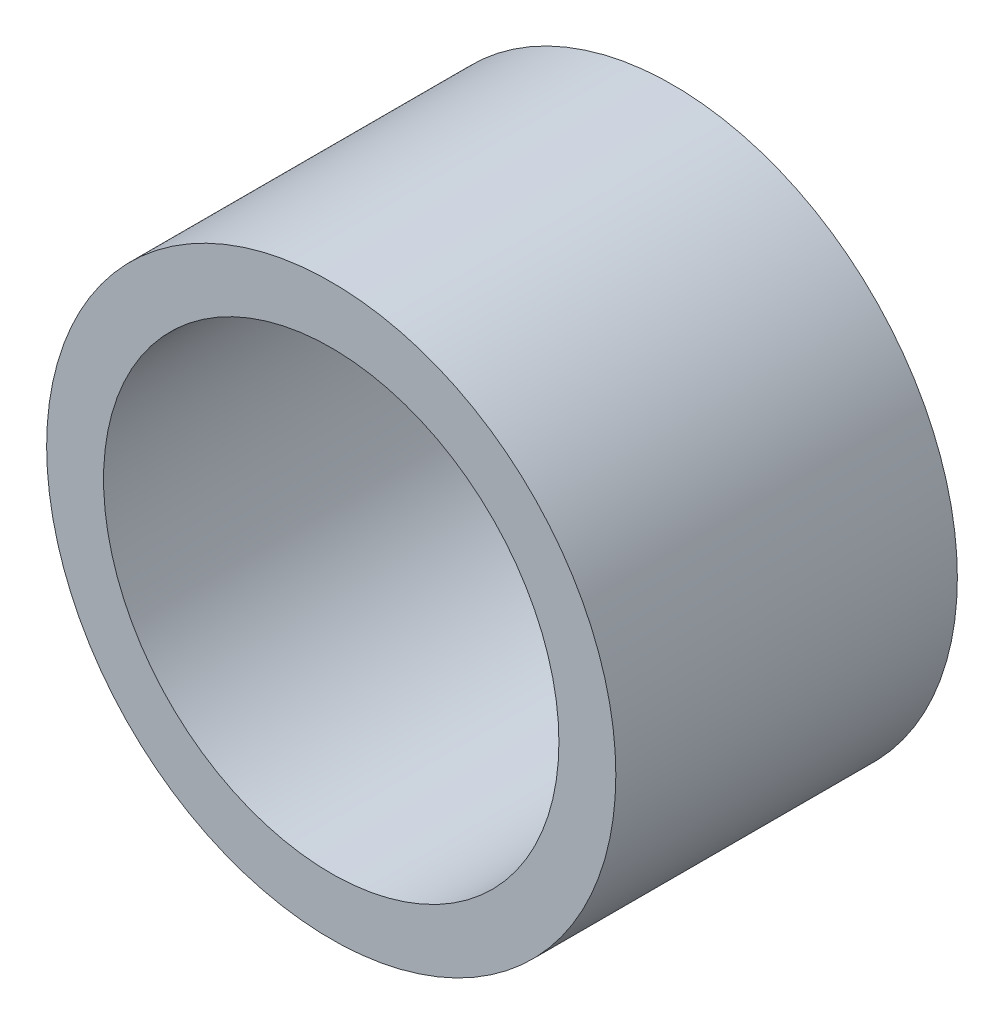
ISO-10303-21;
HEADER;
FILE_DESCRIPTION(('STEP AP214'),'2;1');
FILE_NAME('part.step','',(''),(''),'','','');
FILE_SCHEMA(('AUTOMOTIVE_DESIGN { 1 0 10303 214 1 1 1 1 }'));
ENDSEC;
DATA;
#1=APPLICATION_CONTEXT('core data for automotive mechanical design processes');
#2=APPLICATION_PROTOCOL_DEFINITION('international standard','automotive_design',2000,#1);
#3=PRODUCT_CONTEXT('',#1,'mechanical');
#4=PRODUCT('Part','Part','',(#3));
#5=PRODUCT_RELATED_PRODUCT_CATEGORY('part','',(#4));
#6=PRODUCT_DEFINITION_FORMATION('','',#4);
#7=PRODUCT_DEFINITION_CONTEXT('part definition',#1,'design');
#8=PRODUCT_DEFINITION('design','',#6,#7);
#9=PRODUCT_DEFINITION_SHAPE('','',#8);
#10=(LENGTH_UNIT() NAMED_UNIT(*) SI_UNIT(.MILLI.,.METRE.));
#11=(NAMED_UNIT(*) PLANE_ANGLE_UNIT() SI_UNIT($,.RADIAN.));
#12=(NAMED_UNIT(*) SI_UNIT($,.STERADIAN.) SOLID_ANGLE_UNIT());
#13=UNCERTAINTY_MEASURE_WITH_UNIT(LENGTH_MEASURE(1.E-05),#10,'distance_accuracy_value','');
#14=(GEOMETRIC_REPRESENTATION_CONTEXT(3) GLOBAL_UNCERTAINTY_ASSIGNED_CONTEXT((#13)) GLOBAL_UNIT_ASSIGNED_CONTEXT((#10,
#11,#12)) REPRESENTATION_CONTEXT('',''));
#15=CARTESIAN_POINT('',(0.,0.,0.));
#16=DIRECTION('',(0.,0.,1.));
#17=DIRECTION('',(1.,0.,0.));
#18=AXIS2_PLACEMENT_3D('',#15,#16,#17);
#19=CARTESIAN_POINT('',(0.,0.,4.7625));
#20=DIRECTION('',(0.,0.,1.));
#21=DIRECTION('',(1.,0.,0.));
#22=AXIS2_PLACEMENT_3D('',#19,#20,#21);
#23=PLANE('',#22);
#24=CARTESIAN_POINT('',(0.,0.,4.7625));
#25=DIRECTION('',(0.,0.,1.));
#26=DIRECTION('',(1.,0.,0.));
#27=AXIS2_PLACEMENT_3D('',#24,#25,#26);
#28=CIRCLE('',#27,7.9375);
#29=CARTESIAN_POINT('',(7.9375,0.,4.7625));
#30=VERTEX_POINT('',#29);
#31=EDGE_CURVE('E10',#30,#30,#28,.T.);
#32=ORIENTED_EDGE('',*,*,#31,.T.);
#33=EDGE_LOOP('',(#32));
#34=FACE_BOUND('',#33,.T.);
#35=CARTESIAN_POINT('',(0.,0.,4.7625));
#36=DIRECTION('',(0.,0.,1.));
#37=DIRECTION('',(1.,0.,0.));
#38=AXIS2_PLACEMENT_3D('',#35,#36,#37);
#39=CIRCLE('',#38,6.35);
#40=CARTESIAN_POINT('',(6.35,0.,4.7625));
#41=VERTEX_POINT('',#40);
#42=EDGE_CURVE('E43',#41,#41,#39,.T.);
#43=ORIENTED_EDGE('',*,*,#42,.F.);
#44=EDGE_LOOP('',(#43));
#45=FACE_BOUND('',#44,.T.);
#46=ADVANCED_FACE('F32',(#34,#45),#23,.T.);
#47=CARTESIAN_POINT('',(0.,0.,-4.7625));
#48=DIRECTION('',(0.,0.,1.));
#49=DIRECTION('',(1.,0.,0.));
#50=AXIS2_PLACEMENT_3D('',#47,#48,#49);
#51=PLANE('',#50);
#52=CARTESIAN_POINT('',(0.,0.,-4.7625));
#53=DIRECTION('',(0.,0.,1.));
#54=DIRECTION('',(1.,0.,0.));
#55=AXIS2_PLACEMENT_3D('',#52,#53,#54);
#56=CIRCLE('',#55,7.9375);
#57=CARTESIAN_POINT('',(7.9375,0.,-4.7625));
#58=VERTEX_POINT('',#57);
#59=EDGE_CURVE('E36',#58,#58,#56,.T.);
#60=ORIENTED_EDGE('',*,*,#59,.F.);
#61=EDGE_LOOP('',(#60));
#62=FACE_BOUND('',#61,.T.);
#63=CARTESIAN_POINT('',(0.,0.,-4.7625));
#64=DIRECTION('',(0.,0.,1.));
#65=DIRECTION('',(1.,0.,0.));
#66=AXIS2_PLACEMENT_3D('',#63,#64,#65);
#67=CIRCLE('',#66,6.35);
#68=CARTESIAN_POINT('',(6.35,0.,-4.7625));
#69=VERTEX_POINT('',#68);
#70=EDGE_CURVE('E45',#69,#69,#67,.T.);
#71=ORIENTED_EDGE('',*,*,#70,.T.);
#72=EDGE_LOOP('',(#71));
#73=FACE_BOUND('',#72,.T.);
#74=ADVANCED_FACE('F55',(#62,#73),#51,.F.);
#75=CARTESIAN_POINT('',(0.,0.,4.7625));
#76=DIRECTION('',(0.,0.,-1.));
#77=DIRECTION('',(-1.,0.,0.));
#78=AXIS2_PLACEMENT_3D('',#75,#76,#77);
#79=CYLINDRICAL_SURFACE('',#78,7.9375);
#80=ORIENTED_EDGE('',*,*,#31,.F.);
#81=EDGE_LOOP('',(#80));
#82=FACE_BOUND('',#81,.T.);
#83=ORIENTED_EDGE('',*,*,#59,.T.);
#84=EDGE_LOOP('',(#83));
#85=FACE_BOUND('',#84,.T.);
#86=ADVANCED_FACE('F34',(#82,#85),#79,.T.);
#87=CARTESIAN_POINT('',(0.,0.,4.7625));
#88=DIRECTION('',(0.,0.,-1.));
#89=DIRECTION('',(-1.,0.,0.));
#90=AXIS2_PLACEMENT_3D('',#87,#88,#89);
#91=CYLINDRICAL_SURFACE('',#90,6.35);
#92=ORIENTED_EDGE('',*,*,#42,.T.);
#93=EDGE_LOOP('',(#92));
#94=FACE_BOUND('',#93,.T.);
#95=ORIENTED_EDGE('',*,*,#70,.F.);
#96=EDGE_LOOP('',(#95));
#97=FACE_BOUND('',#96,.T.);
#98=ADVANCED_FACE('F51',(#94,#97),#91,.F.);
#99=CLOSED_SHELL('',(#46,#74,#86,#98));
#100=MANIFOLD_SOLID_BREP('B2',#99);
#101=ADVANCED_BREP_SHAPE_REPRESENTATION('',(#18,#100),#14);
#102=SHAPE_DEFINITION_REPRESENTATION(#9,#101);
ENDSEC;
END-ISO-10303-21;
